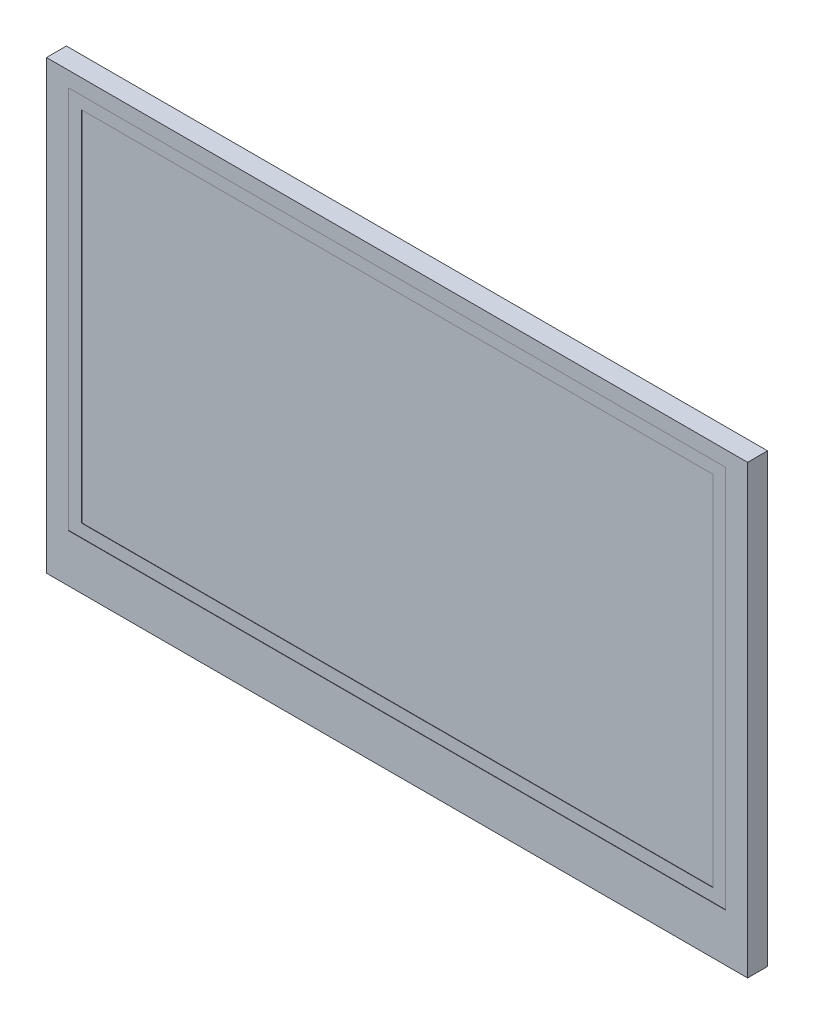
ISO-10303-21;
HEADER;
FILE_DESCRIPTION(('STEP AP214'),'2;1');
FILE_NAME('part.step','',(''),(''),'','','');
FILE_SCHEMA(('AUTOMOTIVE_DESIGN { 1 0 10303 214 1 1 1 1 }'));
ENDSEC;
DATA;
#1=APPLICATION_CONTEXT('core data for automotive mechanical design processes');
#2=APPLICATION_PROTOCOL_DEFINITION('international standard','automotive_design',2000,#1);
#3=PRODUCT_CONTEXT('',#1,'mechanical');
#4=PRODUCT('Part','Part','',(#3));
#5=PRODUCT_RELATED_PRODUCT_CATEGORY('part','',(#4));
#6=PRODUCT_DEFINITION_FORMATION('','',#4);
#7=PRODUCT_DEFINITION_CONTEXT('part definition',#1,'design');
#8=PRODUCT_DEFINITION('design','',#6,#7);
#9=PRODUCT_DEFINITION_SHAPE('','',#8);
#10=(LENGTH_UNIT() NAMED_UNIT(*) SI_UNIT(.MILLI.,.METRE.));
#11=(NAMED_UNIT(*) PLANE_ANGLE_UNIT() SI_UNIT($,.RADIAN.));
#12=(NAMED_UNIT(*) SI_UNIT($,.STERADIAN.) SOLID_ANGLE_UNIT());
#13=UNCERTAINTY_MEASURE_WITH_UNIT(LENGTH_MEASURE(1.E-05),#10,'distance_accuracy_value','');
#14=(GEOMETRIC_REPRESENTATION_CONTEXT(3) GLOBAL_UNCERTAINTY_ASSIGNED_CONTEXT((#13)) GLOBAL_UNIT_ASSIGNED_CONTEXT((#10,
#11,#12)) REPRESENTATION_CONTEXT('',''));
#15=CARTESIAN_POINT('',(0.,0.,0.));
#16=DIRECTION('',(0.,0.,1.));
#17=DIRECTION('',(1.,0.,0.));
#18=AXIS2_PLACEMENT_3D('',#15,#16,#17);
#19=CARTESIAN_POINT('',(0.,31.3,3.));
#20=DIRECTION('',(0.,1.,0.));
#21=DIRECTION('',(0.,0.,1.));
#22=AXIS2_PLACEMENT_3D('',#19,#20,#21);
#23=PLANE('',#22);
#24=DIRECTION('',(0.,0.,-1.));
#25=VECTOR('',#24,1.);
#26=CARTESIAN_POINT('',(-49.45,31.3,3.));
#27=LINE('',#26,#25);
#28=CARTESIAN_POINT('',(-49.45,31.3,3.));
#29=VERTEX_POINT('',#28);
#30=CARTESIAN_POINT('',(-49.45,31.3,2.95));
#31=VERTEX_POINT('',#30);
#32=EDGE_CURVE('E259',#29,#31,#27,.T.);
#33=ORIENTED_EDGE('',*,*,#32,.T.);
#34=DIRECTION('',(1.,0.,0.));
#35=VECTOR('',#34,1.);
#36=CARTESIAN_POINT('',(0.,31.3,2.95));
#37=LINE('',#36,#35);
#38=CARTESIAN_POINT('',(49.45,31.3,2.95));
#39=VERTEX_POINT('',#38);
#40=EDGE_CURVE('E184',#31,#39,#37,.T.);
#41=ORIENTED_EDGE('',*,*,#40,.T.);
#42=DIRECTION('',(0.,0.,-1.));
#43=VECTOR('',#42,1.);
#44=CARTESIAN_POINT('',(49.45,31.3,3.));
#45=LINE('',#44,#43);
#46=CARTESIAN_POINT('',(49.45,31.3,3.));
#47=VERTEX_POINT('',#46);
#48=EDGE_CURVE('E11',#47,#39,#45,.T.);
#49=ORIENTED_EDGE('',*,*,#48,.F.);
#50=DIRECTION('',(1.,0.,0.));
#51=VECTOR('',#50,1.);
#52=CARTESIAN_POINT('',(0.,31.3,3.));
#53=LINE('',#52,#51);
#54=EDGE_CURVE('E229',#29,#47,#53,.T.);
#55=ORIENTED_EDGE('',*,*,#54,.F.);
#56=EDGE_LOOP('',(#33,#41,#49,#55));
#57=FACE_BOUND('',#56,.T.);
#58=ADVANCED_FACE('F42',(#57),#23,.F.);
#59=CARTESIAN_POINT('',(49.45,0.,3.));
#60=DIRECTION('',(1.,0.,0.));
#61=DIRECTION('',(0.,0.,-1.));
#62=AXIS2_PLACEMENT_3D('',#59,#60,#61);
#63=PLANE('',#62);
#64=ORIENTED_EDGE('',*,*,#48,.T.);
#65=DIRECTION('',(0.,-1.,0.));
#66=VECTOR('',#65,1.);
#67=CARTESIAN_POINT('',(49.45,0.,2.95));
#68=LINE('',#67,#66);
#69=CARTESIAN_POINT('',(49.45,-26.4,2.95));
#70=VERTEX_POINT('',#69);
#71=EDGE_CURVE('E172',#39,#70,#68,.T.);
#72=ORIENTED_EDGE('',*,*,#71,.T.);
#73=DIRECTION('',(0.,0.,-1.));
#74=VECTOR('',#73,1.);
#75=CARTESIAN_POINT('',(49.45,-26.4,3.));
#76=LINE('',#75,#74);
#77=CARTESIAN_POINT('',(49.45,-26.4,3.));
#78=VERTEX_POINT('',#77);
#79=EDGE_CURVE('E52',#78,#70,#76,.T.);
#80=ORIENTED_EDGE('',*,*,#79,.F.);
#81=DIRECTION('',(0.,-1.,0.));
#82=VECTOR('',#81,1.);
#83=CARTESIAN_POINT('',(49.45,0.,3.));
#84=LINE('',#83,#82);
#85=EDGE_CURVE('E233',#47,#78,#84,.T.);
#86=ORIENTED_EDGE('',*,*,#85,.F.);
#87=EDGE_LOOP('',(#64,#72,#80,#86));
#88=FACE_BOUND('',#87,.T.);
#89=ADVANCED_FACE('F301',(#88),#63,.F.);
#90=CARTESIAN_POINT('',(0.,-26.4,3.));
#91=DIRECTION('',(0.,1.,0.));
#92=DIRECTION('',(0.,0.,1.));
#93=AXIS2_PLACEMENT_3D('',#90,#91,#92);
#94=PLANE('',#93);
#95=DIRECTION('',(1.,0.,0.));
#96=VECTOR('',#95,1.);
#97=CARTESIAN_POINT('',(0.,-26.4,2.95));
#98=LINE('',#97,#96);
#99=CARTESIAN_POINT('',(-49.45,-26.4,2.95));
#100=VERTEX_POINT('',#99);
#101=EDGE_CURVE('E191',#100,#70,#98,.T.);
#102=ORIENTED_EDGE('',*,*,#101,.F.);
#103=DIRECTION('',(0.,0.,-1.));
#104=VECTOR('',#103,1.);
#105=CARTESIAN_POINT('',(-49.45,-26.4,3.));
#106=LINE('',#105,#104);
#107=CARTESIAN_POINT('',(-49.45,-26.4,3.));
#108=VERTEX_POINT('',#107);
#109=EDGE_CURVE('E262',#108,#100,#106,.T.);
#110=ORIENTED_EDGE('',*,*,#109,.F.);
#111=DIRECTION('',(1.,0.,0.));
#112=VECTOR('',#111,1.);
#113=CARTESIAN_POINT('',(0.,-26.4,3.));
#114=LINE('',#113,#112);
#115=EDGE_CURVE('E236',#108,#78,#114,.T.);
#116=ORIENTED_EDGE('',*,*,#115,.T.);
#117=ORIENTED_EDGE('',*,*,#79,.T.);
#118=EDGE_LOOP('',(#102,#110,#116,#117));
#119=FACE_BOUND('',#118,.T.);
#120=ADVANCED_FACE('F307',(#119),#94,.T.);
#121=CARTESIAN_POINT('',(0.,33.6,3.));
#122=DIRECTION('',(0.,-1.,0.));
#123=DIRECTION('',(1.,0.,0.));
#124=AXIS2_PLACEMENT_3D('',#121,#122,#123);
#125=PLANE('',#124);
#126=DIRECTION('',(-1.,0.,0.));
#127=VECTOR('',#126,1.);
#128=CARTESIAN_POINT('',(0.,33.6,0.));
#129=LINE('',#128,#127);
#130=CARTESIAN_POINT('',(52.75,33.6,0.));
#131=VERTEX_POINT('',#130);
#132=CARTESIAN_POINT('',(-52.75,33.6,0.));
#133=VERTEX_POINT('',#132);
#134=EDGE_CURVE('E212',#131,#133,#129,.T.);
#135=ORIENTED_EDGE('',*,*,#134,.T.);
#136=DIRECTION('',(0.,0.,-1.));
#137=VECTOR('',#136,1.);
#138=CARTESIAN_POINT('',(-52.75,33.6,3.));
#139=LINE('',#138,#137);
#140=CARTESIAN_POINT('',(-52.75,33.6,3.));
#141=VERTEX_POINT('',#140);
#142=EDGE_CURVE('E46',#141,#133,#139,.T.);
#143=ORIENTED_EDGE('',*,*,#142,.F.);
#144=DIRECTION('',(-1.,0.,0.));
#145=VECTOR('',#144,1.);
#146=CARTESIAN_POINT('',(0.,33.6,3.));
#147=LINE('',#146,#145);
#148=CARTESIAN_POINT('',(52.75,33.6,3.));
#149=VERTEX_POINT('',#148);
#150=EDGE_CURVE('E213',#149,#141,#147,.T.);
#151=ORIENTED_EDGE('',*,*,#150,.F.);
#152=DIRECTION('',(0.,0.,-1.));
#153=VECTOR('',#152,1.);
#154=CARTESIAN_POINT('',(52.75,33.6,3.));
#155=LINE('',#154,#153);
#156=EDGE_CURVE('E244',#149,#131,#155,.T.);
#157=ORIENTED_EDGE('',*,*,#156,.T.);
#158=EDGE_LOOP('',(#135,#143,#151,#157));
#159=FACE_BOUND('',#158,.T.);
#160=ADVANCED_FACE('F44',(#159),#125,.F.);
#161=CARTESIAN_POINT('',(-52.75,0.,3.));
#162=DIRECTION('',(1.,0.,0.));
#163=DIRECTION('',(0.,1.,0.));
#164=AXIS2_PLACEMENT_3D('',#161,#162,#163);
#165=PLANE('',#164);
#166=DIRECTION('',(0.,-1.,0.));
#167=VECTOR('',#166,1.);
#168=CARTESIAN_POINT('',(-52.75,0.,0.));
#169=LINE('',#168,#167);
#170=CARTESIAN_POINT('',(-52.75,-33.6,0.));
#171=VERTEX_POINT('',#170);
#172=EDGE_CURVE('E248',#133,#171,#169,.T.);
#173=ORIENTED_EDGE('',*,*,#172,.T.);
#174=DIRECTION('',(0.,0.,-1.));
#175=VECTOR('',#174,1.);
#176=CARTESIAN_POINT('',(-52.75,-33.6,3.));
#177=LINE('',#176,#175);
#178=CARTESIAN_POINT('',(-52.75,-33.6,3.));
#179=VERTEX_POINT('',#178);
#180=EDGE_CURVE('E272',#179,#171,#177,.T.);
#181=ORIENTED_EDGE('',*,*,#180,.F.);
#182=DIRECTION('',(0.,-1.,0.));
#183=VECTOR('',#182,1.);
#184=CARTESIAN_POINT('',(-52.75,0.,3.));
#185=LINE('',#184,#183);
#186=EDGE_CURVE('E217',#141,#179,#185,.T.);
#187=ORIENTED_EDGE('',*,*,#186,.F.);
#188=ORIENTED_EDGE('',*,*,#142,.T.);
#189=EDGE_LOOP('',(#173,#181,#187,#188));
#190=FACE_BOUND('',#189,.T.);
#191=ADVANCED_FACE('F280',(#190),#165,.F.);
#192=CARTESIAN_POINT('',(0.,-33.6,3.));
#193=DIRECTION('',(0.,-1.,0.));
#194=DIRECTION('',(1.,0.,0.));
#195=AXIS2_PLACEMENT_3D('',#192,#193,#194);
#196=PLANE('',#195);
#197=DIRECTION('',(-1.,0.,0.));
#198=VECTOR('',#197,1.);
#199=CARTESIAN_POINT('',(0.,-33.6,0.));
#200=LINE('',#199,#198);
#201=CARTESIAN_POINT('',(52.75,-33.6,0.));
#202=VERTEX_POINT('',#201);
#203=EDGE_CURVE('E252',#202,#171,#200,.T.);
#204=ORIENTED_EDGE('',*,*,#203,.F.);
#205=DIRECTION('',(0.,0.,-1.));
#206=VECTOR('',#205,1.);
#207=CARTESIAN_POINT('',(52.75,-33.6,3.));
#208=LINE('',#207,#206);
#209=CARTESIAN_POINT('',(52.75,-33.6,3.));
#210=VERTEX_POINT('',#209);
#211=EDGE_CURVE('E270',#210,#202,#208,.T.);
#212=ORIENTED_EDGE('',*,*,#211,.F.);
#213=DIRECTION('',(-1.,0.,0.));
#214=VECTOR('',#213,1.);
#215=CARTESIAN_POINT('',(0.,-33.6,3.));
#216=LINE('',#215,#214);
#217=EDGE_CURVE('E221',#210,#179,#216,.T.);
#218=ORIENTED_EDGE('',*,*,#217,.T.);
#219=ORIENTED_EDGE('',*,*,#180,.T.);
#220=EDGE_LOOP('',(#204,#212,#218,#219));
#221=FACE_BOUND('',#220,.T.);
#222=ADVANCED_FACE('F291',(#221),#196,.T.);
#223=CARTESIAN_POINT('',(52.75,0.,3.));
#224=DIRECTION('',(1.,0.,0.));
#225=DIRECTION('',(0.,1.,0.));
#226=AXIS2_PLACEMENT_3D('',#223,#224,#225);
#227=PLANE('',#226);
#228=DIRECTION('',(0.,-1.,0.));
#229=VECTOR('',#228,1.);
#230=CARTESIAN_POINT('',(52.75,0.,0.));
#231=LINE('',#230,#229);
#232=EDGE_CURVE('E218',#131,#202,#231,.T.);
#233=ORIENTED_EDGE('',*,*,#232,.F.);
#234=ORIENTED_EDGE('',*,*,#156,.F.);
#235=DIRECTION('',(0.,-1.,0.));
#236=VECTOR('',#235,1.);
#237=CARTESIAN_POINT('',(52.75,0.,3.));
#238=LINE('',#237,#236);
#239=EDGE_CURVE('E225',#149,#210,#238,.T.);
#240=ORIENTED_EDGE('',*,*,#239,.T.);
#241=ORIENTED_EDGE('',*,*,#211,.T.);
#242=EDGE_LOOP('',(#233,#234,#240,#241));
#243=FACE_BOUND('',#242,.T.);
#244=ADVANCED_FACE('F288',(#243),#227,.T.);
#245=CARTESIAN_POINT('',(-49.45,0.,3.));
#246=DIRECTION('',(1.,0.,0.));
#247=DIRECTION('',(0.,0.,-1.));
#248=AXIS2_PLACEMENT_3D('',#245,#246,#247);
#249=PLANE('',#248);
#250=DIRECTION('',(0.,-1.,0.));
#251=VECTOR('',#250,1.);
#252=CARTESIAN_POINT('',(-49.45,0.,2.95));
#253=LINE('',#252,#251);
#254=EDGE_CURVE('E187',#31,#100,#253,.T.);
#255=ORIENTED_EDGE('',*,*,#254,.F.);
#256=ORIENTED_EDGE('',*,*,#32,.F.);
#257=DIRECTION('',(0.,-1.,0.));
#258=VECTOR('',#257,1.);
#259=CARTESIAN_POINT('',(-49.45,0.,3.));
#260=LINE('',#259,#258);
#261=EDGE_CURVE('E240',#29,#108,#260,.T.);
#262=ORIENTED_EDGE('',*,*,#261,.T.);
#263=ORIENTED_EDGE('',*,*,#109,.T.);
#264=EDGE_LOOP('',(#255,#256,#262,#263));
#265=FACE_BOUND('',#264,.T.);
#266=ADVANCED_FACE('F298',(#265),#249,.T.);
#267=CARTESIAN_POINT('',(0.,0.,3.));
#268=DIRECTION('',(0.,0.,1.));
#269=DIRECTION('',(1.,0.,0.));
#270=AXIS2_PLACEMENT_3D('',#267,#268,#269);
#271=PLANE('',#270);
#272=ORIENTED_EDGE('',*,*,#150,.T.);
#273=ORIENTED_EDGE('',*,*,#186,.T.);
#274=ORIENTED_EDGE('',*,*,#217,.F.);
#275=ORIENTED_EDGE('',*,*,#239,.F.);
#276=EDGE_LOOP('',(#272,#273,#274,#275));
#277=FACE_BOUND('',#276,.T.);
#278=ORIENTED_EDGE('',*,*,#54,.T.);
#279=ORIENTED_EDGE('',*,*,#85,.T.);
#280=ORIENTED_EDGE('',*,*,#115,.F.);
#281=ORIENTED_EDGE('',*,*,#261,.F.);
#282=EDGE_LOOP('',(#278,#279,#280,#281));
#283=FACE_BOUND('',#282,.T.);
#284=ADVANCED_FACE('F316',(#277,#283),#271,.T.);
#285=CARTESIAN_POINT('',(0.,0.,0.));
#286=DIRECTION('',(0.,0.,1.));
#287=DIRECTION('',(1.,0.,0.));
#288=AXIS2_PLACEMENT_3D('',#285,#286,#287);
#289=PLANE('',#288);
#290=ORIENTED_EDGE('',*,*,#134,.F.);
#291=ORIENTED_EDGE('',*,*,#232,.T.);
#292=ORIENTED_EDGE('',*,*,#203,.T.);
#293=ORIENTED_EDGE('',*,*,#172,.F.);
#294=EDGE_LOOP('',(#290,#291,#292,#293));
#295=FACE_BOUND('',#294,.T.);
#296=ADVANCED_FACE('F286',(#295),#289,.F.);
#297=CARTESIAN_POINT('',(0.,29.38,2.95));
#298=DIRECTION('',(0.,1.,0.));
#299=DIRECTION('',(0.,0.,1.));
#300=AXIS2_PLACEMENT_3D('',#297,#298,#299);
#301=PLANE('',#300);
#302=DIRECTION('',(0.,0.,-1.));
#303=VECTOR('',#302,1.);
#304=CARTESIAN_POINT('',(-47.52,29.38,2.95));
#305=LINE('',#304,#303);
#306=CARTESIAN_POINT('',(-47.52,29.38,2.95));
#307=VERTEX_POINT('',#306);
#308=CARTESIAN_POINT('',(-47.52,29.38,2.9));
#309=VERTEX_POINT('',#308);
#310=EDGE_CURVE('E165',#307,#309,#305,.T.);
#311=ORIENTED_EDGE('',*,*,#310,.T.);
#312=DIRECTION('',(1.,0.,0.));
#313=VECTOR('',#312,1.);
#314=CARTESIAN_POINT('',(0.,29.38,2.9));
#315=LINE('',#314,#313);
#316=CARTESIAN_POINT('',(47.52,29.38,2.9));
#317=VERTEX_POINT('',#316);
#318=EDGE_CURVE('E63',#309,#317,#315,.T.);
#319=ORIENTED_EDGE('',*,*,#318,.T.);
#320=DIRECTION('',(0.,0.,-1.));
#321=VECTOR('',#320,1.);
#322=CARTESIAN_POINT('',(47.52,29.38,2.95));
#323=LINE('',#322,#321);
#324=CARTESIAN_POINT('',(47.52,29.38,2.95));
#325=VERTEX_POINT('',#324);
#326=EDGE_CURVE('E209',#325,#317,#323,.T.);
#327=ORIENTED_EDGE('',*,*,#326,.F.);
#328=DIRECTION('',(1.,0.,0.));
#329=VECTOR('',#328,1.);
#330=CARTESIAN_POINT('',(0.,29.38,2.95));
#331=LINE('',#330,#329);
#332=EDGE_CURVE('E195',#307,#325,#331,.T.);
#333=ORIENTED_EDGE('',*,*,#332,.F.);
#334=EDGE_LOOP('',(#311,#319,#327,#333));
#335=FACE_BOUND('',#334,.T.);
#336=ADVANCED_FACE('F320',(#335),#301,.F.);
#337=CARTESIAN_POINT('',(47.52,0.,2.95));
#338=DIRECTION('',(1.,0.,0.));
#339=DIRECTION('',(0.,1.,0.));
#340=AXIS2_PLACEMENT_3D('',#337,#338,#339);
#341=PLANE('',#340);
#342=ORIENTED_EDGE('',*,*,#326,.T.);
#343=DIRECTION('',(0.,-1.,0.));
#344=VECTOR('',#343,1.);
#345=CARTESIAN_POINT('',(47.52,0.,2.9));
#346=LINE('',#345,#344);
#347=CARTESIAN_POINT('',(47.52,-24.476,2.9));
#348=VERTEX_POINT('',#347);
#349=EDGE_CURVE('E73',#317,#348,#346,.T.);
#350=ORIENTED_EDGE('',*,*,#349,.T.);
#351=DIRECTION('',(0.,0.,-1.));
#352=VECTOR('',#351,1.);
#353=CARTESIAN_POINT('',(47.52,-24.476,2.95));
#354=LINE('',#353,#352);
#355=CARTESIAN_POINT('',(47.52,-24.476,2.95));
#356=VERTEX_POINT('',#355);
#357=EDGE_CURVE('E164',#356,#348,#354,.T.);
#358=ORIENTED_EDGE('',*,*,#357,.F.);
#359=DIRECTION('',(0.,-1.,0.));
#360=VECTOR('',#359,1.);
#361=CARTESIAN_POINT('',(47.52,0.,2.95));
#362=LINE('',#361,#360);
#363=EDGE_CURVE('E199',#325,#356,#362,.T.);
#364=ORIENTED_EDGE('',*,*,#363,.F.);
#365=EDGE_LOOP('',(#342,#350,#358,#364));
#366=FACE_BOUND('',#365,.T.);
#367=ADVANCED_FACE('F326',(#366),#341,.F.);
#368=CARTESIAN_POINT('',(0.,-24.476,2.95));
#369=DIRECTION('',(0.,1.,0.));
#370=DIRECTION('',(-1.,0.,0.));
#371=AXIS2_PLACEMENT_3D('',#368,#369,#370);
#372=PLANE('',#371);
#373=DIRECTION('',(1.,0.,0.));
#374=VECTOR('',#373,1.);
#375=CARTESIAN_POINT('',(0.,-24.476,2.9));
#376=LINE('',#375,#374);
#377=CARTESIAN_POINT('',(-47.52,-24.476,2.9));
#378=VERTEX_POINT('',#377);
#379=EDGE_CURVE('E168',#378,#348,#376,.T.);
#380=ORIENTED_EDGE('',*,*,#379,.F.);
#381=DIRECTION('',(0.,0.,-1.));
#382=VECTOR('',#381,1.);
#383=CARTESIAN_POINT('',(-47.52,-24.476,2.95));
#384=LINE('',#383,#382);
#385=CARTESIAN_POINT('',(-47.52,-24.476,2.95));
#386=VERTEX_POINT('',#385);
#387=EDGE_CURVE('E153',#386,#378,#384,.T.);
#388=ORIENTED_EDGE('',*,*,#387,.F.);
#389=DIRECTION('',(1.,0.,0.));
#390=VECTOR('',#389,1.);
#391=CARTESIAN_POINT('',(0.,-24.476,2.95));
#392=LINE('',#391,#390);
#393=EDGE_CURVE('E202',#386,#356,#392,.T.);
#394=ORIENTED_EDGE('',*,*,#393,.T.);
#395=ORIENTED_EDGE('',*,*,#357,.T.);
#396=EDGE_LOOP('',(#380,#388,#394,#395));
#397=FACE_BOUND('',#396,.T.);
#398=ADVANCED_FACE('F169',(#397),#372,.T.);
#399=CARTESIAN_POINT('',(-47.52,0.,2.95));
#400=DIRECTION('',(1.,0.,0.));
#401=DIRECTION('',(0.,1.,0.));
#402=AXIS2_PLACEMENT_3D('',#399,#400,#401);
#403=PLANE('',#402);
#404=DIRECTION('',(0.,-1.,0.));
#405=VECTOR('',#404,1.);
#406=CARTESIAN_POINT('',(-47.52,0.,2.9));
#407=LINE('',#406,#405);
#408=EDGE_CURVE('E157',#309,#378,#407,.T.);
#409=ORIENTED_EDGE('',*,*,#408,.F.);
#410=ORIENTED_EDGE('',*,*,#310,.F.);
#411=DIRECTION('',(0.,-1.,0.));
#412=VECTOR('',#411,1.);
#413=CARTESIAN_POINT('',(-47.52,0.,2.95));
#414=LINE('',#413,#412);
#415=EDGE_CURVE('E159',#307,#386,#414,.T.);
#416=ORIENTED_EDGE('',*,*,#415,.T.);
#417=ORIENTED_EDGE('',*,*,#387,.T.);
#418=EDGE_LOOP('',(#409,#410,#416,#417));
#419=FACE_BOUND('',#418,.T.);
#420=ADVANCED_FACE('F155',(#419),#403,.T.);
#421=CARTESIAN_POINT('',(0.,0.,2.95));
#422=DIRECTION('',(0.,0.,1.));
#423=DIRECTION('',(1.,0.,0.));
#424=AXIS2_PLACEMENT_3D('',#421,#422,#423);
#425=PLANE('',#424);
#426=ORIENTED_EDGE('',*,*,#71,.F.);
#427=ORIENTED_EDGE('',*,*,#40,.F.);
#428=ORIENTED_EDGE('',*,*,#254,.T.);
#429=ORIENTED_EDGE('',*,*,#101,.T.);
#430=EDGE_LOOP('',(#426,#427,#428,#429));
#431=FACE_BOUND('',#430,.T.);
#432=ORIENTED_EDGE('',*,*,#332,.T.);
#433=ORIENTED_EDGE('',*,*,#363,.T.);
#434=ORIENTED_EDGE('',*,*,#393,.F.);
#435=ORIENTED_EDGE('',*,*,#415,.F.);
#436=EDGE_LOOP('',(#432,#433,#434,#435));
#437=FACE_BOUND('',#436,.T.);
#438=ADVANCED_FACE('F333',(#431,#437),#425,.T.);
#439=CARTESIAN_POINT('',(0.,0.,2.9));
#440=DIRECTION('',(0.,0.,1.));
#441=DIRECTION('',(1.,0.,0.));
#442=AXIS2_PLACEMENT_3D('',#439,#440,#441);
#443=PLANE('',#442);
#444=ORIENTED_EDGE('',*,*,#349,.F.);
#445=ORIENTED_EDGE('',*,*,#318,.F.);
#446=ORIENTED_EDGE('',*,*,#408,.T.);
#447=ORIENTED_EDGE('',*,*,#379,.T.);
#448=EDGE_LOOP('',(#444,#445,#446,#447));
#449=FACE_BOUND('',#448,.T.);
#450=ADVANCED_FACE('F174',(#449),#443,.T.);
#451=CLOSED_SHELL('',(#58,#89,#120,#160,#191,#222,#244,#266,#284,#296,#336,#367,#398,#420,#438,#450));
#452=MANIFOLD_SOLID_BREP('B2',#451);
#453=ADVANCED_BREP_SHAPE_REPRESENTATION('',(#18,#452),#14);
#454=SHAPE_DEFINITION_REPRESENTATION(#9,#453);
ENDSEC;
END-ISO-10303-21;
